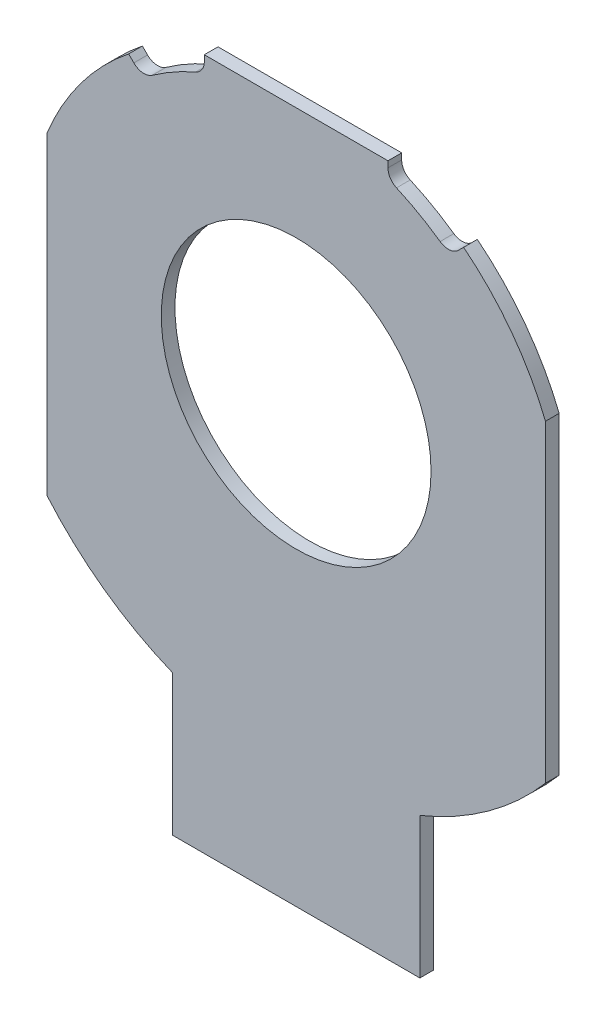
ISO-10303-21;
HEADER;
FILE_DESCRIPTION(('STEP AP214'),'2;1');
FILE_NAME('part.step','',(''),(''),'','','');
FILE_SCHEMA(('AUTOMOTIVE_DESIGN { 1 0 10303 214 1 1 1 1 }'));
ENDSEC;
DATA;
#1=APPLICATION_CONTEXT('core data for automotive mechanical design processes');
#2=APPLICATION_PROTOCOL_DEFINITION('international standard','automotive_design',2000,#1);
#3=PRODUCT_CONTEXT('',#1,'mechanical');
#4=PRODUCT('Part','Part','',(#3));
#5=PRODUCT_RELATED_PRODUCT_CATEGORY('part','',(#4));
#6=PRODUCT_DEFINITION_FORMATION('','',#4);
#7=PRODUCT_DEFINITION_CONTEXT('part definition',#1,'design');
#8=PRODUCT_DEFINITION('design','',#6,#7);
#9=PRODUCT_DEFINITION_SHAPE('','',#8);
#10=(LENGTH_UNIT() NAMED_UNIT(*) SI_UNIT(.MILLI.,.METRE.));
#11=(NAMED_UNIT(*) PLANE_ANGLE_UNIT() SI_UNIT($,.RADIAN.));
#12=(NAMED_UNIT(*) SI_UNIT($,.STERADIAN.) SOLID_ANGLE_UNIT());
#13=UNCERTAINTY_MEASURE_WITH_UNIT(LENGTH_MEASURE(1.E-05),#10,'distance_accuracy_value','');
#14=(GEOMETRIC_REPRESENTATION_CONTEXT(3) GLOBAL_UNCERTAINTY_ASSIGNED_CONTEXT((#13)) GLOBAL_UNIT_ASSIGNED_CONTEXT((#10,
#11,#12)) REPRESENTATION_CONTEXT('',''));
#15=CARTESIAN_POINT('',(0.,0.,0.));
#16=DIRECTION('',(0.,0.,1.));
#17=DIRECTION('',(1.,0.,0.));
#18=AXIS2_PLACEMENT_3D('',#15,#16,#17);
#19=CARTESIAN_POINT('',(36.958016,26.337768,0.73152));
#20=DIRECTION('',(0.,0.,1.));
#21=DIRECTION('',(1.,0.,0.));
#22=AXIS2_PLACEMENT_3D('',#19,#20,#21);
#23=PLANE('',#22);
#24=CARTESIAN_POINT('',(50.8,50.8,0.73152));
#25=DIRECTION('',(0.,0.,1.));
#26=DIRECTION('',(1.,0.,0.));
#27=AXIS2_PLACEMENT_3D('',#24,#25,#26);
#28=CIRCLE('',#27,7.2009);
#29=CARTESIAN_POINT('',(58.0009,50.8,0.73152));
#30=VERTEX_POINT('',#29);
#31=EDGE_CURVE('E163',#30,#30,#28,.F.);
#32=ORIENTED_EDGE('',*,*,#31,.T.);
#33=EDGE_LOOP('',(#32));
#34=FACE_BOUND('',#33,.T.);
#35=CARTESIAN_POINT('',(50.800430289081,50.800257236722,0.73152));
#36=DIRECTION('',(0.,0.,1.));
#37=DIRECTION('',(1.,0.,0.));
#38=AXIS2_PLACEMENT_3D('',#35,#36,#37);
#39=CIRCLE('',#38,14.351140314299);
#40=CARTESIAN_POINT('',(64.1095999999948,56.1687979999829,0.73152));
#41=VERTEX_POINT('',#40);
#42=CARTESIAN_POINT('',(59.7405459999947,62.0265459999947,0.73152));
#43=VERTEX_POINT('',#42);
#44=EDGE_CURVE('E275',#41,#43,#39,.T.);
#45=ORIENTED_EDGE('',*,*,#44,.T.);
#46=DIRECTION('',(0.707106781186548,0.707106781186548,0.));
#47=VECTOR('',#46,1.);
#48=CARTESIAN_POINT('',(59.602243,61.888243,0.73152));
#49=LINE('',#48,#47);
#50=CARTESIAN_POINT('',(59.4639400000046,61.7499399999954,0.73152));
#51=VERTEX_POINT('',#50);
#52=EDGE_CURVE('E207',#43,#51,#49,.F.);
#53=ORIENTED_EDGE('',*,*,#52,.T.);
#54=CARTESIAN_POINT('',(58.9250725721236,62.2888447776366,0.73152));
#55=DIRECTION('',(0.,0.,1.));
#56=DIRECTION('',(1.,0.,0.));
#57=AXIS2_PLACEMENT_3D('',#54,#55,#56);
#58=CIRCLE('',#57,0.762100035563186);
#59=CARTESIAN_POINT('',(58.4850240000005,61.6666280000007,0.73152));
#60=VERTEX_POINT('',#59);
#61=EDGE_CURVE('E274',#51,#60,#58,.F.);
#62=ORIENTED_EDGE('',*,*,#61,.T.);
#63=CARTESIAN_POINT('',(50.8006416761868,50.8016894474212,0.73152));
#64=DIRECTION('',(0.,0.,1.));
#65=DIRECTION('',(1.,0.,0.));
#66=AXIS2_PLACEMENT_3D('',#63,#64,#65);
#67=CIRCLE('',#66,13.307765456679);
#68=CARTESIAN_POINT('',(56.157621999996,62.9836179999909,0.73152));
#69=VERTEX_POINT('',#68);
#70=EDGE_CURVE('E271',#60,#69,#67,.T.);
#71=ORIENTED_EDGE('',*,*,#70,.T.);
#72=CARTESIAN_POINT('',(56.4642072259444,63.6812285845322,0.73152));
#73=DIRECTION('',(0.,0.,1.));
#74=DIRECTION('',(1.,0.,0.));
#75=AXIS2_PLACEMENT_3D('',#72,#73,#74);
#76=CIRCLE('',#75,0.762007236485396);
#77=CARTESIAN_POINT('',(55.7021999999866,63.681102,0.73152));
#78=VERTEX_POINT('',#77);
#79=EDGE_CURVE('E268',#69,#78,#76,.F.);
#80=ORIENTED_EDGE('',*,*,#79,.T.);
#81=DIRECTION('',(0.,-1.,0.));
#82=VECTOR('',#81,1.);
#83=CARTESIAN_POINT('',(55.7022,63.844551,0.73152));
#84=LINE('',#83,#82);
#85=CARTESIAN_POINT('',(55.7022,64.008,0.73152));
#86=VERTEX_POINT('',#85);
#87=EDGE_CURVE('E202',#78,#86,#84,.F.);
#88=ORIENTED_EDGE('',*,*,#87,.T.);
#89=DIRECTION('',(1.,0.,0.));
#90=VECTOR('',#89,1.);
#91=CARTESIAN_POINT('',(50.8,64.008,0.73152));
#92=LINE('',#91,#90);
#93=CARTESIAN_POINT('',(45.8978,64.008,0.73152));
#94=VERTEX_POINT('',#93);
#95=EDGE_CURVE('E197',#86,#94,#92,.F.);
#96=ORIENTED_EDGE('',*,*,#95,.T.);
#97=DIRECTION('',(0.,1.,0.));
#98=VECTOR('',#97,1.);
#99=CARTESIAN_POINT('',(45.8978,63.844551,0.73152));
#100=LINE('',#99,#98);
#101=CARTESIAN_POINT('',(45.8978000000008,63.681102,0.73152));
#102=VERTEX_POINT('',#101);
#103=EDGE_CURVE('E191',#94,#102,#100,.F.);
#104=ORIENTED_EDGE('',*,*,#103,.T.);
#105=CARTESIAN_POINT('',(45.1357927740556,63.6812285845322,0.73152));
#106=DIRECTION('',(0.,0.,1.));
#107=DIRECTION('',(1.,0.,0.));
#108=AXIS2_PLACEMENT_3D('',#105,#106,#107);
#109=CIRCLE('',#108,0.762007236460006);
#110=CARTESIAN_POINT('',(45.4423779999938,62.9836180000142,0.73152));
#111=VERTEX_POINT('',#110);
#112=EDGE_CURVE('E266',#102,#111,#109,.F.);
#113=ORIENTED_EDGE('',*,*,#112,.T.);
#114=CARTESIAN_POINT('',(50.7993583238132,50.8016894474212,0.73152));
#115=DIRECTION('',(0.,0.,1.));
#116=DIRECTION('',(1.,0.,0.));
#117=AXIS2_PLACEMENT_3D('',#114,#115,#116);
#118=CIRCLE('',#117,13.3077654567044);
#119=CARTESIAN_POINT('',(43.1149759999922,61.6666280000111,0.73152));
#120=VERTEX_POINT('',#119);
#121=EDGE_CURVE('E263',#111,#120,#118,.T.);
#122=ORIENTED_EDGE('',*,*,#121,.T.);
#123=CARTESIAN_POINT('',(42.6749274278764,62.2888447776366,0.73152));
#124=DIRECTION('',(0.,0.,1.));
#125=DIRECTION('',(1.,0.,0.));
#126=AXIS2_PLACEMENT_3D('',#123,#124,#125);
#127=CIRCLE('',#126,0.7621000355632);
#128=CARTESIAN_POINT('',(42.1360599999955,61.7499399999954,0.73152));
#129=VERTEX_POINT('',#128);
#130=EDGE_CURVE('E260',#120,#129,#127,.F.);
#131=ORIENTED_EDGE('',*,*,#130,.T.);
#132=DIRECTION('',(0.707106781186527,-0.707106781186568,0.));
#133=VECTOR('',#132,1.);
#134=CARTESIAN_POINT('',(41.997757,61.888243,0.73152));
#135=LINE('',#134,#133);
#136=CARTESIAN_POINT('',(41.8594540000098,62.026545999989,0.73152));
#137=VERTEX_POINT('',#136);
#138=EDGE_CURVE('E187',#129,#137,#135,.F.);
#139=ORIENTED_EDGE('',*,*,#138,.T.);
#140=CARTESIAN_POINT('',(50.799569710919,50.800257236722,0.73152));
#141=DIRECTION('',(0.,0.,1.));
#142=DIRECTION('',(1.,0.,0.));
#143=AXIS2_PLACEMENT_3D('',#140,#141,#142);
#144=CIRCLE('',#143,14.351140314299);
#145=CARTESIAN_POINT('',(37.4904,56.168797999985,0.73152));
#146=VERTEX_POINT('',#145);
#147=EDGE_CURVE('E258',#137,#146,#144,.T.);
#148=ORIENTED_EDGE('',*,*,#147,.T.);
#149=DIRECTION('',(0.,1.,0.));
#150=VECTOR('',#149,1.);
#151=CARTESIAN_POINT('',(37.4904,47.802673,0.73152));
#152=LINE('',#151,#150);
#153=CARTESIAN_POINT('',(37.4903999999911,39.4365479999744,0.73152));
#154=VERTEX_POINT('',#153);
#155=EDGE_CURVE('E183',#146,#154,#152,.F.);
#156=ORIENTED_EDGE('',*,*,#155,.T.);
#157=CARTESIAN_POINT('',(50.7996599464256,50.800665610683,0.73152));
#158=DIRECTION('',(0.,0.,1.));
#159=DIRECTION('',(1.,0.,0.));
#160=AXIS2_PLACEMENT_3D('',#157,#158,#159);
#161=CIRCLE('',#160,17.5008448193732);
#162=CARTESIAN_POINT('',(44.196,34.5935299999894,0.73152));
#163=VERTEX_POINT('',#162);
#164=EDGE_CURVE('E256',#154,#163,#161,.T.);
#165=ORIENTED_EDGE('',*,*,#164,.T.);
#166=DIRECTION('',(0.,1.,0.));
#167=VECTOR('',#166,1.);
#168=CARTESIAN_POINT('',(44.196,30.834965,0.73152));
#169=LINE('',#168,#167);
#170=CARTESIAN_POINT('',(44.196,27.0764,0.73152));
#171=VERTEX_POINT('',#170);
#172=EDGE_CURVE('E178',#163,#171,#169,.F.);
#173=ORIENTED_EDGE('',*,*,#172,.T.);
#174=DIRECTION('',(-1.,0.,0.));
#175=VECTOR('',#174,1.);
#176=CARTESIAN_POINT('',(50.8,27.0764,0.73152));
#177=LINE('',#176,#175);
#178=CARTESIAN_POINT('',(57.404,27.0764,0.73152));
#179=VERTEX_POINT('',#178);
#180=EDGE_CURVE('E166',#171,#179,#177,.F.);
#181=ORIENTED_EDGE('',*,*,#180,.T.);
#182=DIRECTION('',(0.,-1.,0.));
#183=VECTOR('',#182,1.);
#184=CARTESIAN_POINT('',(57.404,30.834965,0.73152));
#185=LINE('',#184,#183);
#186=CARTESIAN_POINT('',(57.404,34.5935300000031,0.73152));
#187=VERTEX_POINT('',#186);
#188=EDGE_CURVE('E162',#179,#187,#185,.F.);
#189=ORIENTED_EDGE('',*,*,#188,.T.);
#190=CARTESIAN_POINT('',(50.8003400535744,50.800665610683,0.73152));
#191=DIRECTION('',(0.,0.,1.));
#192=DIRECTION('',(1.,0.,0.));
#193=AXIS2_PLACEMENT_3D('',#190,#191,#192);
#194=CIRCLE('',#193,17.5008448193478);
#195=CARTESIAN_POINT('',(64.1096,39.4365480000016,0.73152));
#196=VERTEX_POINT('',#195);
#197=EDGE_CURVE('E20',#187,#196,#194,.T.);
#198=ORIENTED_EDGE('',*,*,#197,.T.);
#199=DIRECTION('',(0.,-1.,0.));
#200=VECTOR('',#199,1.);
#201=CARTESIAN_POINT('',(64.1096,47.802673,0.73152));
#202=LINE('',#201,#200);
#203=EDGE_CURVE('E211',#196,#41,#202,.F.);
#204=ORIENTED_EDGE('',*,*,#203,.T.);
#205=EDGE_LOOP('',(#45,#53,#62,#71,#80,#88,#96,#104,#113,#122,#131,#139,#148,#156,#165,#173,
#181,#189,#198,#204));
#206=FACE_BOUND('',#205,.T.);
#207=ADVANCED_FACE('F16',(#34,#206),#23,.T.);
#208=CARTESIAN_POINT('',(50.8003400535744,50.800665610683,0.));
#209=DIRECTION('',(0.,0.,1.));
#210=DIRECTION('',(1.,0.,0.));
#211=AXIS2_PLACEMENT_3D('',#208,#209,#210);
#212=CYLINDRICAL_SURFACE('',#211,17.5008448193478);
#213=ORIENTED_EDGE('',*,*,#197,.F.);
#214=DIRECTION('',(0.,0.,1.));
#215=VECTOR('',#214,1.);
#216=CARTESIAN_POINT('',(57.404,34.59353,0.365760000000038));
#217=LINE('',#216,#215);
#218=CARTESIAN_POINT('',(57.404,34.5935300000031,0.));
#219=VERTEX_POINT('',#218);
#220=EDGE_CURVE('E156',#187,#219,#217,.F.);
#221=ORIENTED_EDGE('',*,*,#220,.T.);
#222=CARTESIAN_POINT('',(50.8003400535744,50.800665610683,0.));
#223=DIRECTION('',(0.,0.,1.));
#224=DIRECTION('',(1.,0.,0.));
#225=AXIS2_PLACEMENT_3D('',#222,#223,#224);
#226=CIRCLE('',#225,17.5008448193478);
#227=CARTESIAN_POINT('',(64.1096,39.4365480000016,0.));
#228=VERTEX_POINT('',#227);
#229=EDGE_CURVE('E252',#219,#228,#226,.T.);
#230=ORIENTED_EDGE('',*,*,#229,.T.);
#231=DIRECTION('',(0.,0.,-1.));
#232=VECTOR('',#231,1.);
#233=CARTESIAN_POINT('',(64.1096,39.436548,0.365760000000038));
#234=LINE('',#233,#232);
#235=EDGE_CURVE('E157',#228,#196,#234,.F.);
#236=ORIENTED_EDGE('',*,*,#235,.T.);
#237=EDGE_LOOP('',(#213,#221,#230,#236));
#238=FACE_BOUND('',#237,.T.);
#239=ADVANCED_FACE('F154',(#238),#212,.T.);
#240=CARTESIAN_POINT('',(64.1096,39.101903,-0.0546370424944798));
#241=DIRECTION('',(1.,0.,0.));
#242=DIRECTION('',(0.,1.,0.));
#243=AXIS2_PLACEMENT_3D('',#240,#241,#242);
#244=PLANE('',#243);
#245=ORIENTED_EDGE('',*,*,#203,.F.);
#246=ORIENTED_EDGE('',*,*,#235,.F.);
#247=DIRECTION('',(0.,1.,0.));
#248=VECTOR('',#247,1.);
#249=CARTESIAN_POINT('',(64.1096,45.5422,0.));
#250=LINE('',#249,#248);
#251=CARTESIAN_POINT('',(64.1095999999948,56.1687979999829,0.));
#252=VERTEX_POINT('',#251);
#253=EDGE_CURVE('E251',#228,#252,#250,.T.);
#254=ORIENTED_EDGE('',*,*,#253,.T.);
#255=DIRECTION('',(0.,0.,1.));
#256=VECTOR('',#255,1.);
#257=CARTESIAN_POINT('',(64.1095999999896,56.1687979999958,0.365760000000038));
#258=LINE('',#257,#256);
#259=EDGE_CURVE('E212',#252,#41,#258,.T.);
#260=ORIENTED_EDGE('',*,*,#259,.T.);
#261=EDGE_LOOP('',(#245,#246,#254,#260));
#262=FACE_BOUND('',#261,.T.);
#263=ADVANCED_FACE('F415',(#262),#244,.T.);
#264=CARTESIAN_POINT('',(50.800430289081,50.800257236722,0.));
#265=DIRECTION('',(0.,0.,1.));
#266=DIRECTION('',(1.,0.,0.));
#267=AXIS2_PLACEMENT_3D('',#264,#265,#266);
#268=CYLINDRICAL_SURFACE('',#267,14.351140314299);
#269=ORIENTED_EDGE('',*,*,#44,.F.);
#270=ORIENTED_EDGE('',*,*,#259,.F.);
#271=CARTESIAN_POINT('',(50.800430289081,50.800257236722,0.));
#272=DIRECTION('',(0.,0.,1.));
#273=DIRECTION('',(1.,0.,0.));
#274=AXIS2_PLACEMENT_3D('',#271,#272,#273);
#275=CIRCLE('',#274,14.351140314299);
#276=CARTESIAN_POINT('',(59.7405459999947,62.0265459999947,0.));
#277=VERTEX_POINT('',#276);
#278=EDGE_CURVE('E248',#252,#277,#275,.T.);
#279=ORIENTED_EDGE('',*,*,#278,.T.);
#280=DIRECTION('',(0.,0.,-1.));
#281=VECTOR('',#280,1.);
#282=CARTESIAN_POINT('',(59.740546,62.026546,0.365760000000038));
#283=LINE('',#282,#281);
#284=EDGE_CURVE('E210',#277,#43,#283,.F.);
#285=ORIENTED_EDGE('',*,*,#284,.T.);
#286=EDGE_LOOP('',(#269,#270,#279,#285));
#287=FACE_BOUND('',#286,.T.);
#288=ADVANCED_FACE('F413',(#287),#268,.T.);
#289=CARTESIAN_POINT('',(59.7791802232394,62.0651802232394,-0.0546370424944798));
#290=DIRECTION('',(-0.707106781186541,0.707106781186555,0.));
#291=DIRECTION('',(-0.707106781186554,-0.707106781186541,0.));
#292=AXIS2_PLACEMENT_3D('',#289,#290,#291);
#293=PLANE('',#292);
#294=ORIENTED_EDGE('',*,*,#52,.F.);
#295=ORIENTED_EDGE('',*,*,#284,.F.);
#296=DIRECTION('',(-0.707106781186554,-0.707106781186541,0.));
#297=VECTOR('',#296,1.);
#298=CARTESIAN_POINT('',(59.7791802232394,62.0651802232394,0.));
#299=LINE('',#298,#297);
#300=CARTESIAN_POINT('',(59.4639400000069,61.7499399999931,0.));
#301=VERTEX_POINT('',#300);
#302=EDGE_CURVE('E245',#277,#301,#299,.T.);
#303=ORIENTED_EDGE('',*,*,#302,.T.);
#304=DIRECTION('',(0.,0.,-1.));
#305=VECTOR('',#304,1.);
#306=CARTESIAN_POINT('',(59.4639400000092,61.7499399999909,0.365760000000038));
#307=LINE('',#306,#305);
#308=EDGE_CURVE('E209',#301,#51,#307,.F.);
#309=ORIENTED_EDGE('',*,*,#308,.T.);
#310=EDGE_LOOP('',(#294,#295,#303,#309));
#311=FACE_BOUND('',#310,.T.);
#312=ADVANCED_FACE('F409',(#311),#293,.T.);
#313=CARTESIAN_POINT('',(58.9250725721236,62.2888447776366,0.));
#314=DIRECTION('',(0.,0.,1.));
#315=DIRECTION('',(1.,0.,0.));
#316=AXIS2_PLACEMENT_3D('',#313,#314,#315);
#317=CYLINDRICAL_SURFACE('',#316,0.762100035563186);
#318=ORIENTED_EDGE('',*,*,#61,.F.);
#319=ORIENTED_EDGE('',*,*,#308,.F.);
#320=CARTESIAN_POINT('',(58.9250725721236,62.2888447776366,0.));
#321=DIRECTION('',(0.,0.,1.));
#322=DIRECTION('',(1.,0.,0.));
#323=AXIS2_PLACEMENT_3D('',#320,#321,#322);
#324=CIRCLE('',#323,0.762100035563186);
#325=CARTESIAN_POINT('',(58.4850240000029,61.6666280000041,0.));
#326=VERTEX_POINT('',#325);
#327=EDGE_CURVE('E242',#301,#326,#324,.F.);
#328=ORIENTED_EDGE('',*,*,#327,.T.);
#329=DIRECTION('',(0.,0.,1.));
#330=VECTOR('',#329,1.);
#331=CARTESIAN_POINT('',(58.4850240000029,61.6666280000041,0.365760000000038));
#332=LINE('',#331,#330);
#333=EDGE_CURVE('E273',#326,#60,#332,.T.);
#334=ORIENTED_EDGE('',*,*,#333,.T.);
#335=EDGE_LOOP('',(#318,#319,#328,#334));
#336=FACE_BOUND('',#335,.T.);
#337=ADVANCED_FACE('F407',(#336),#317,.F.);
#338=CARTESIAN_POINT('',(50.8006416761868,50.8016894474212,0.));
#339=DIRECTION('',(0.,0.,1.));
#340=DIRECTION('',(1.,0.,0.));
#341=AXIS2_PLACEMENT_3D('',#338,#339,#340);
#342=CYLINDRICAL_SURFACE('',#341,13.307765456679);
#343=ORIENTED_EDGE('',*,*,#70,.F.);
#344=ORIENTED_EDGE('',*,*,#333,.F.);
#345=CARTESIAN_POINT('',(50.8006416761868,50.8016894474212,0.));
#346=DIRECTION('',(0.,0.,1.));
#347=DIRECTION('',(1.,0.,0.));
#348=AXIS2_PLACEMENT_3D('',#345,#346,#347);
#349=CIRCLE('',#348,13.307765456679);
#350=CARTESIAN_POINT('',(56.1576219999902,62.9836179999776,0.));
#351=VERTEX_POINT('',#350);
#352=EDGE_CURVE('E239',#326,#351,#349,.T.);
#353=ORIENTED_EDGE('',*,*,#352,.T.);
#354=DIRECTION('',(0.,0.,-1.));
#355=VECTOR('',#354,1.);
#356=CARTESIAN_POINT('',(56.1576219999902,62.9836179999776,0.365760000000038));
#357=LINE('',#356,#355);
#358=EDGE_CURVE('E270',#351,#69,#357,.F.);
#359=ORIENTED_EDGE('',*,*,#358,.T.);
#360=EDGE_LOOP('',(#343,#344,#353,#359));
#361=FACE_BOUND('',#360,.T.);
#362=ADVANCED_FACE('F402',(#361),#342,.T.);
#363=CARTESIAN_POINT('',(56.4642072259444,63.6812285845322,0.));
#364=DIRECTION('',(0.,0.,1.));
#365=DIRECTION('',(1.,0.,0.));
#366=AXIS2_PLACEMENT_3D('',#363,#364,#365);
#367=CYLINDRICAL_SURFACE('',#366,0.762007236485396);
#368=ORIENTED_EDGE('',*,*,#79,.F.);
#369=ORIENTED_EDGE('',*,*,#358,.F.);
#370=CARTESIAN_POINT('',(56.4642072259444,63.6812285845322,0.));
#371=DIRECTION('',(0.,0.,1.));
#372=DIRECTION('',(1.,0.,0.));
#373=AXIS2_PLACEMENT_3D('',#370,#371,#372);
#374=CIRCLE('',#373,0.762007236485396);
#375=CARTESIAN_POINT('',(55.7022,63.681102,0.));
#376=VERTEX_POINT('',#375);
#377=EDGE_CURVE('E235',#351,#376,#374,.F.);
#378=ORIENTED_EDGE('',*,*,#377,.T.);
#379=DIRECTION('',(0.,0.,-1.));
#380=VECTOR('',#379,1.);
#381=CARTESIAN_POINT('',(55.7022,63.681102,0.365760000000038));
#382=LINE('',#381,#380);
#383=EDGE_CURVE('E204',#376,#78,#382,.F.);
#384=ORIENTED_EDGE('',*,*,#383,.T.);
#385=EDGE_LOOP('',(#368,#369,#378,#384));
#386=FACE_BOUND('',#385,.T.);
#387=ADVANCED_FACE('F399',(#386),#367,.F.);
#388=CARTESIAN_POINT('',(55.7022,63.626464957509,-0.0546370424944798));
#389=DIRECTION('',(1.,0.,0.));
#390=DIRECTION('',(0.,1.,0.));
#391=AXIS2_PLACEMENT_3D('',#388,#389,#390);
#392=PLANE('',#391);
#393=ORIENTED_EDGE('',*,*,#87,.F.);
#394=ORIENTED_EDGE('',*,*,#383,.F.);
#395=DIRECTION('',(0.,1.,0.));
#396=VECTOR('',#395,1.);
#397=CARTESIAN_POINT('',(55.7022,45.5422,0.));
#398=LINE('',#397,#396);
#399=CARTESIAN_POINT('',(55.7022,64.008,0.));
#400=VERTEX_POINT('',#399);
#401=EDGE_CURVE('E238',#376,#400,#398,.T.);
#402=ORIENTED_EDGE('',*,*,#401,.T.);
#403=DIRECTION('',(0.,0.,-1.));
#404=VECTOR('',#403,1.);
#405=CARTESIAN_POINT('',(55.7022,64.008,0.365760000000038));
#406=LINE('',#405,#404);
#407=EDGE_CURVE('E199',#400,#86,#406,.F.);
#408=ORIENTED_EDGE('',*,*,#407,.T.);
#409=EDGE_LOOP('',(#393,#394,#402,#408));
#410=FACE_BOUND('',#409,.T.);
#411=ADVANCED_FACE('F394',(#410),#392,.T.);
#412=CARTESIAN_POINT('',(55.898288,64.008,-0.0546370424944798));
#413=DIRECTION('',(0.,1.,0.));
#414=DIRECTION('',(-1.,0.,0.));
#415=AXIS2_PLACEMENT_3D('',#412,#413,#414);
#416=PLANE('',#415);
#417=ORIENTED_EDGE('',*,*,#95,.F.);
#418=ORIENTED_EDGE('',*,*,#407,.F.);
#419=DIRECTION('',(-1.,0.,0.));
#420=VECTOR('',#419,1.);
#421=CARTESIAN_POINT('',(50.8,64.008,0.));
#422=LINE('',#421,#420);
#423=CARTESIAN_POINT('',(45.8978,64.008,0.));
#424=VERTEX_POINT('',#423);
#425=EDGE_CURVE('E298',#400,#424,#422,.T.);
#426=ORIENTED_EDGE('',*,*,#425,.T.);
#427=DIRECTION('',(0.,0.,-1.));
#428=VECTOR('',#427,1.);
#429=CARTESIAN_POINT('',(45.8978,64.008,0.365760000000038));
#430=LINE('',#429,#428);
#431=EDGE_CURVE('E194',#424,#94,#430,.F.);
#432=ORIENTED_EDGE('',*,*,#431,.T.);
#433=EDGE_LOOP('',(#417,#418,#426,#432));
#434=FACE_BOUND('',#433,.T.);
#435=ADVANCED_FACE('F391',(#434),#416,.T.);
#436=CARTESIAN_POINT('',(45.8978,64.062637042491,-0.0546370424944798));
#437=DIRECTION('',(-1.,0.,0.));
#438=DIRECTION('',(0.,-1.,0.));
#439=AXIS2_PLACEMENT_3D('',#436,#437,#438);
#440=PLANE('',#439);
#441=ORIENTED_EDGE('',*,*,#103,.F.);
#442=ORIENTED_EDGE('',*,*,#431,.F.);
#443=DIRECTION('',(0.,-1.,0.));
#444=VECTOR('',#443,1.);
#445=CARTESIAN_POINT('',(45.8978,45.5422,0.));
#446=LINE('',#445,#444);
#447=CARTESIAN_POINT('',(45.8978000000011,63.681102,0.));
#448=VERTEX_POINT('',#447);
#449=EDGE_CURVE('E234',#424,#448,#446,.T.);
#450=ORIENTED_EDGE('',*,*,#449,.T.);
#451=DIRECTION('',(0.,0.,-1.));
#452=VECTOR('',#451,1.);
#453=CARTESIAN_POINT('',(45.8978000000015,63.681102,0.365760000000038));
#454=LINE('',#453,#452);
#455=EDGE_CURVE('E193',#448,#102,#454,.F.);
#456=ORIENTED_EDGE('',*,*,#455,.T.);
#457=EDGE_LOOP('',(#441,#442,#450,#456));
#458=FACE_BOUND('',#457,.T.);
#459=ADVANCED_FACE('F386',(#458),#440,.T.);
#460=CARTESIAN_POINT('',(45.1357927740556,63.6812285845322,0.));
#461=DIRECTION('',(0.,0.,1.));
#462=DIRECTION('',(1.,0.,0.));
#463=AXIS2_PLACEMENT_3D('',#460,#461,#462);
#464=CYLINDRICAL_SURFACE('',#463,0.762007236460006);
#465=ORIENTED_EDGE('',*,*,#112,.F.);
#466=ORIENTED_EDGE('',*,*,#455,.F.);
#467=CARTESIAN_POINT('',(45.1357927740556,63.6812285845322,0.));
#468=DIRECTION('',(0.,0.,1.));
#469=DIRECTION('',(1.,0.,0.));
#470=AXIS2_PLACEMENT_3D('',#467,#468,#469);
#471=CIRCLE('',#470,0.762007236460006);
#472=CARTESIAN_POINT('',(45.4423779999879,62.9836180000275,0.));
#473=VERTEX_POINT('',#472);
#474=EDGE_CURVE('E231',#448,#473,#471,.F.);
#475=ORIENTED_EDGE('',*,*,#474,.T.);
#476=DIRECTION('',(0.,0.,1.));
#477=VECTOR('',#476,1.);
#478=CARTESIAN_POINT('',(45.4423779999879,62.9836180000275,0.365760000000038));
#479=LINE('',#478,#477);
#480=EDGE_CURVE('E265',#473,#111,#479,.T.);
#481=ORIENTED_EDGE('',*,*,#480,.T.);
#482=EDGE_LOOP('',(#465,#466,#475,#481));
#483=FACE_BOUND('',#482,.T.);
#484=ADVANCED_FACE('F383',(#483),#464,.F.);
#485=CARTESIAN_POINT('',(50.7993583238132,50.8016894474212,0.));
#486=DIRECTION('',(0.,0.,1.));
#487=DIRECTION('',(1.,0.,0.));
#488=AXIS2_PLACEMENT_3D('',#485,#486,#487);
#489=CYLINDRICAL_SURFACE('',#488,13.3077654567044);
#490=ORIENTED_EDGE('',*,*,#121,.F.);
#491=ORIENTED_EDGE('',*,*,#480,.F.);
#492=CARTESIAN_POINT('',(50.7993583238132,50.8016894474212,0.));
#493=DIRECTION('',(0.,0.,1.));
#494=DIRECTION('',(1.,0.,0.));
#495=AXIS2_PLACEMENT_3D('',#492,#493,#494);
#496=CIRCLE('',#495,13.3077654567044);
#497=CARTESIAN_POINT('',(43.1149760000019,61.6666279999974,0.));
#498=VERTEX_POINT('',#497);
#499=EDGE_CURVE('E228',#473,#498,#496,.T.);
#500=ORIENTED_EDGE('',*,*,#499,.T.);
#501=DIRECTION('',(0.,0.,-1.));
#502=VECTOR('',#501,1.);
#503=CARTESIAN_POINT('',(43.1149760000019,61.6666279999974,0.365760000000038));
#504=LINE('',#503,#502);
#505=EDGE_CURVE('E262',#498,#120,#504,.F.);
#506=ORIENTED_EDGE('',*,*,#505,.T.);
#507=EDGE_LOOP('',(#490,#491,#500,#506));
#508=FACE_BOUND('',#507,.T.);
#509=ADVANCED_FACE('F378',(#508),#489,.T.);
#510=CARTESIAN_POINT('',(42.6749274278764,62.2888447776366,0.));
#511=DIRECTION('',(0.,0.,1.));
#512=DIRECTION('',(1.,0.,0.));
#513=AXIS2_PLACEMENT_3D('',#510,#511,#512);
#514=CYLINDRICAL_SURFACE('',#513,0.7621000355632);
#515=ORIENTED_EDGE('',*,*,#130,.F.);
#516=ORIENTED_EDGE('',*,*,#505,.F.);
#517=CARTESIAN_POINT('',(42.6749274278764,62.2888447776366,0.));
#518=DIRECTION('',(0.,0.,1.));
#519=DIRECTION('',(1.,0.,0.));
#520=AXIS2_PLACEMENT_3D('',#517,#518,#519);
#521=CIRCLE('',#520,0.7621000355632);
#522=CARTESIAN_POINT('',(42.13606,61.74994,0.));
#523=VERTEX_POINT('',#522);
#524=EDGE_CURVE('E225',#498,#523,#521,.F.);
#525=ORIENTED_EDGE('',*,*,#524,.T.);
#526=DIRECTION('',(0.,0.,-1.));
#527=VECTOR('',#526,1.);
#528=CARTESIAN_POINT('',(42.13606,61.74994,0.365760000000038));
#529=LINE('',#528,#527);
#530=EDGE_CURVE('E190',#523,#129,#529,.F.);
#531=ORIENTED_EDGE('',*,*,#530,.T.);
#532=EDGE_LOOP('',(#515,#516,#525,#531));
#533=FACE_BOUND('',#532,.T.);
#534=ADVANCED_FACE('F375',(#533),#514,.F.);
#535=CARTESIAN_POINT('',(42.1746942232394,61.7113057767606,-0.0546370424944798));
#536=DIRECTION('',(0.707106781186568,0.707106781186527,0.));
#537=DIRECTION('',(-0.707106781186527,0.707106781186568,0.));
#538=AXIS2_PLACEMENT_3D('',#535,#536,#537);
#539=PLANE('',#538);
#540=ORIENTED_EDGE('',*,*,#138,.F.);
#541=ORIENTED_EDGE('',*,*,#530,.F.);
#542=DIRECTION('',(-0.707106781186527,0.707106781186568,0.));
#543=VECTOR('',#542,1.);
#544=CARTESIAN_POINT('',(42.1746942232394,61.7113057767606,0.));
#545=LINE('',#544,#543);
#546=CARTESIAN_POINT('',(41.8594540000099,62.026545999989,0.));
#547=VERTEX_POINT('',#546);
#548=EDGE_CURVE('E222',#523,#547,#545,.T.);
#549=ORIENTED_EDGE('',*,*,#548,.T.);
#550=DIRECTION('',(0.,0.,1.));
#551=VECTOR('',#550,1.);
#552=CARTESIAN_POINT('',(41.8594540000092,62.0265459999885,0.365760000000038));
#553=LINE('',#552,#551);
#554=EDGE_CURVE('E189',#547,#137,#553,.T.);
#555=ORIENTED_EDGE('',*,*,#554,.T.);
#556=EDGE_LOOP('',(#540,#541,#549,#555));
#557=FACE_BOUND('',#556,.T.);
#558=ADVANCED_FACE('F370',(#557),#539,.T.);
#559=CARTESIAN_POINT('',(50.799569710919,50.800257236722,0.));
#560=DIRECTION('',(0.,0.,1.));
#561=DIRECTION('',(1.,0.,0.));
#562=AXIS2_PLACEMENT_3D('',#559,#560,#561);
#563=CYLINDRICAL_SURFACE('',#562,14.351140314299);
#564=ORIENTED_EDGE('',*,*,#147,.F.);
#565=ORIENTED_EDGE('',*,*,#554,.F.);
#566=CARTESIAN_POINT('',(50.799569710919,50.800257236722,0.));
#567=DIRECTION('',(0.,0.,1.));
#568=DIRECTION('',(1.,0.,0.));
#569=AXIS2_PLACEMENT_3D('',#566,#567,#568);
#570=CIRCLE('',#569,14.351140314299);
#571=CARTESIAN_POINT('',(37.4904,56.168797999985,0.));
#572=VERTEX_POINT('',#571);
#573=EDGE_CURVE('E219',#547,#572,#570,.T.);
#574=ORIENTED_EDGE('',*,*,#573,.T.);
#575=DIRECTION('',(0.,0.,-1.));
#576=VECTOR('',#575,1.);
#577=CARTESIAN_POINT('',(37.4904,56.168798,0.365760000000038));
#578=LINE('',#577,#576);
#579=EDGE_CURVE('E186',#572,#146,#578,.F.);
#580=ORIENTED_EDGE('',*,*,#579,.T.);
#581=EDGE_LOOP('',(#564,#565,#574,#580));
#582=FACE_BOUND('',#581,.T.);
#583=ADVANCED_FACE('F367',(#582),#563,.T.);
#584=CARTESIAN_POINT('',(37.4904,56.503443,-0.0546370424944798));
#585=DIRECTION('',(-1.,0.,0.));
#586=DIRECTION('',(0.,-1.,0.));
#587=AXIS2_PLACEMENT_3D('',#584,#585,#586);
#588=PLANE('',#587);
#589=ORIENTED_EDGE('',*,*,#155,.F.);
#590=ORIENTED_EDGE('',*,*,#579,.F.);
#591=DIRECTION('',(0.,-1.,0.));
#592=VECTOR('',#591,1.);
#593=CARTESIAN_POINT('',(37.4904,45.5422,0.));
#594=LINE('',#593,#592);
#595=CARTESIAN_POINT('',(37.4903999999911,39.4365479999744,0.));
#596=VERTEX_POINT('',#595);
#597=EDGE_CURVE('E218',#572,#596,#594,.T.);
#598=ORIENTED_EDGE('',*,*,#597,.T.);
#599=DIRECTION('',(0.,0.,1.));
#600=VECTOR('',#599,1.);
#601=CARTESIAN_POINT('',(37.4903999999822,39.4365479999848,0.365760000000038));
#602=LINE('',#601,#600);
#603=EDGE_CURVE('E185',#596,#154,#602,.T.);
#604=ORIENTED_EDGE('',*,*,#603,.T.);
#605=EDGE_LOOP('',(#589,#590,#598,#604));
#606=FACE_BOUND('',#605,.T.);
#607=ADVANCED_FACE('F362',(#606),#588,.T.);
#608=CARTESIAN_POINT('',(50.7996599464256,50.800665610683,0.));
#609=DIRECTION('',(0.,0.,1.));
#610=DIRECTION('',(1.,0.,0.));
#611=AXIS2_PLACEMENT_3D('',#608,#609,#610);
#612=CYLINDRICAL_SURFACE('',#611,17.5008448193732);
#613=ORIENTED_EDGE('',*,*,#164,.F.);
#614=ORIENTED_EDGE('',*,*,#603,.F.);
#615=CARTESIAN_POINT('',(50.7996599464256,50.800665610683,0.));
#616=DIRECTION('',(0.,0.,1.));
#617=DIRECTION('',(1.,0.,0.));
#618=AXIS2_PLACEMENT_3D('',#615,#616,#617);
#619=CIRCLE('',#618,17.5008448193732);
#620=CARTESIAN_POINT('',(44.196,34.5935299999894,0.));
#621=VERTEX_POINT('',#620);
#622=EDGE_CURVE('E214',#596,#621,#619,.T.);
#623=ORIENTED_EDGE('',*,*,#622,.T.);
#624=DIRECTION('',(0.,0.,-1.));
#625=VECTOR('',#624,1.);
#626=CARTESIAN_POINT('',(44.196,34.59353,0.365760000000038));
#627=LINE('',#626,#625);
#628=EDGE_CURVE('E180',#621,#163,#627,.F.);
#629=ORIENTED_EDGE('',*,*,#628,.T.);
#630=EDGE_LOOP('',(#613,#614,#623,#629));
#631=FACE_BOUND('',#630,.T.);
#632=ADVANCED_FACE('F359',(#631),#612,.T.);
#633=CARTESIAN_POINT('',(44.196,34.7438726,-0.0546370424944798));
#634=DIRECTION('',(-1.,0.,0.));
#635=DIRECTION('',(0.,-1.,0.));
#636=AXIS2_PLACEMENT_3D('',#633,#634,#635);
#637=PLANE('',#636);
#638=ORIENTED_EDGE('',*,*,#172,.F.);
#639=ORIENTED_EDGE('',*,*,#628,.F.);
#640=DIRECTION('',(0.,-1.,0.));
#641=VECTOR('',#640,1.);
#642=CARTESIAN_POINT('',(44.196,45.5422,0.));
#643=LINE('',#642,#641);
#644=CARTESIAN_POINT('',(44.196,27.0764,0.));
#645=VERTEX_POINT('',#644);
#646=EDGE_CURVE('E217',#621,#645,#643,.T.);
#647=ORIENTED_EDGE('',*,*,#646,.T.);
#648=DIRECTION('',(0.,0.,-1.));
#649=VECTOR('',#648,1.);
#650=CARTESIAN_POINT('',(44.196,27.0764,0.365760000000038));
#651=LINE('',#650,#649);
#652=EDGE_CURVE('E175',#645,#171,#651,.F.);
#653=ORIENTED_EDGE('',*,*,#652,.T.);
#654=EDGE_LOOP('',(#638,#639,#647,#653));
#655=FACE_BOUND('',#654,.T.);
#656=ADVANCED_FACE('F352',(#655),#637,.T.);
#657=CARTESIAN_POINT('',(43.93184,27.0764,-0.0546370424944798));
#658=DIRECTION('',(0.,-1.,0.));
#659=DIRECTION('',(1.,0.,0.));
#660=AXIS2_PLACEMENT_3D('',#657,#658,#659);
#661=PLANE('',#660);
#662=ORIENTED_EDGE('',*,*,#180,.F.);
#663=ORIENTED_EDGE('',*,*,#652,.F.);
#664=DIRECTION('',(1.,0.,0.));
#665=VECTOR('',#664,1.);
#666=CARTESIAN_POINT('',(50.8,27.0764,0.));
#667=LINE('',#666,#665);
#668=CARTESIAN_POINT('',(57.404,27.0764,0.));
#669=VERTEX_POINT('',#668);
#670=EDGE_CURVE('E327',#645,#669,#667,.T.);
#671=ORIENTED_EDGE('',*,*,#670,.T.);
#672=DIRECTION('',(0.,0.,-1.));
#673=VECTOR('',#672,1.);
#674=CARTESIAN_POINT('',(57.404,27.0764,0.365760000000038));
#675=LINE('',#674,#673);
#676=EDGE_CURVE('E35',#669,#179,#675,.F.);
#677=ORIENTED_EDGE('',*,*,#676,.T.);
#678=EDGE_LOOP('',(#662,#663,#671,#677));
#679=FACE_BOUND('',#678,.T.);
#680=ADVANCED_FACE('F442',(#679),#661,.T.);
#681=CARTESIAN_POINT('',(57.404,26.9260574,-0.0546370424944798));
#682=DIRECTION('',(1.,0.,0.));
#683=DIRECTION('',(0.,1.,0.));
#684=AXIS2_PLACEMENT_3D('',#681,#682,#683);
#685=PLANE('',#684);
#686=ORIENTED_EDGE('',*,*,#188,.F.);
#687=ORIENTED_EDGE('',*,*,#676,.F.);
#688=DIRECTION('',(0.,1.,0.));
#689=VECTOR('',#688,1.);
#690=CARTESIAN_POINT('',(57.404,45.5422,0.));
#691=LINE('',#690,#689);
#692=EDGE_CURVE('E26',#669,#219,#691,.T.);
#693=ORIENTED_EDGE('',*,*,#692,.T.);
#694=ORIENTED_EDGE('',*,*,#220,.F.);
#695=EDGE_LOOP('',(#686,#687,#693,#694));
#696=FACE_BOUND('',#695,.T.);
#697=ADVANCED_FACE('F161',(#696),#685,.T.);
#698=CARTESIAN_POINT('',(50.8,50.8,0.));
#699=DIRECTION('',(0.,0.,1.));
#700=DIRECTION('',(1.,0.,0.));
#701=AXIS2_PLACEMENT_3D('',#698,#699,#700);
#702=CYLINDRICAL_SURFACE('',#701,7.2009);
#703=ORIENTED_EDGE('',*,*,#31,.F.);
#704=EDGE_LOOP('',(#703));
#705=FACE_BOUND('',#704,.T.);
#706=CARTESIAN_POINT('',(50.8,50.8,0.));
#707=DIRECTION('',(0.,0.,1.));
#708=DIRECTION('',(1.,0.,0.));
#709=AXIS2_PLACEMENT_3D('',#706,#707,#708);
#710=CIRCLE('',#709,7.2009);
#711=CARTESIAN_POINT('',(58.0009,50.8,0.));
#712=VERTEX_POINT('',#711);
#713=EDGE_CURVE('E11',#712,#712,#710,.F.);
#714=ORIENTED_EDGE('',*,*,#713,.T.);
#715=EDGE_LOOP('',(#714));
#716=FACE_BOUND('',#715,.T.);
#717=ADVANCED_FACE('F428',(#705,#716),#702,.F.);
#718=CARTESIAN_POINT('',(36.958016,26.337768,0.));
#719=DIRECTION('',(0.,0.,1.));
#720=DIRECTION('',(1.,0.,0.));
#721=AXIS2_PLACEMENT_3D('',#718,#719,#720);
#722=PLANE('',#721);
#723=ORIENTED_EDGE('',*,*,#713,.F.);
#724=EDGE_LOOP('',(#723));
#725=FACE_BOUND('',#724,.T.);
#726=ORIENTED_EDGE('',*,*,#670,.F.);
#727=ORIENTED_EDGE('',*,*,#646,.F.);
#728=ORIENTED_EDGE('',*,*,#622,.F.);
#729=ORIENTED_EDGE('',*,*,#597,.F.);
#730=ORIENTED_EDGE('',*,*,#573,.F.);
#731=ORIENTED_EDGE('',*,*,#548,.F.);
#732=ORIENTED_EDGE('',*,*,#524,.F.);
#733=ORIENTED_EDGE('',*,*,#499,.F.);
#734=ORIENTED_EDGE('',*,*,#474,.F.);
#735=ORIENTED_EDGE('',*,*,#449,.F.);
#736=ORIENTED_EDGE('',*,*,#425,.F.);
#737=ORIENTED_EDGE('',*,*,#401,.F.);
#738=ORIENTED_EDGE('',*,*,#377,.F.);
#739=ORIENTED_EDGE('',*,*,#352,.F.);
#740=ORIENTED_EDGE('',*,*,#327,.F.);
#741=ORIENTED_EDGE('',*,*,#302,.F.);
#742=ORIENTED_EDGE('',*,*,#278,.F.);
#743=ORIENTED_EDGE('',*,*,#253,.F.);
#744=ORIENTED_EDGE('',*,*,#229,.F.);
#745=ORIENTED_EDGE('',*,*,#692,.F.);
#746=EDGE_LOOP('',(#726,#727,#728,#729,#730,#731,#732,#733,#734,#735,#736,#737,#738,#739,#740,
#741,#742,#743,#744,#745));
#747=FACE_BOUND('',#746,.T.);
#748=ADVANCED_FACE('F18',(#725,#747),#722,.F.);
#749=CLOSED_SHELL('',(#207,#239,#263,#288,#312,#337,#362,#387,#411,#435,#459,#484,#509,#534,
#558,#583,#607,#632,#656,#680,#697,#717,#748));
#750=MANIFOLD_SOLID_BREP('B1',#749);
#751=ADVANCED_BREP_SHAPE_REPRESENTATION('',(#18,#750),#14);
#752=SHAPE_DEFINITION_REPRESENTATION(#9,#751);
ENDSEC;
END-ISO-10303-21;
